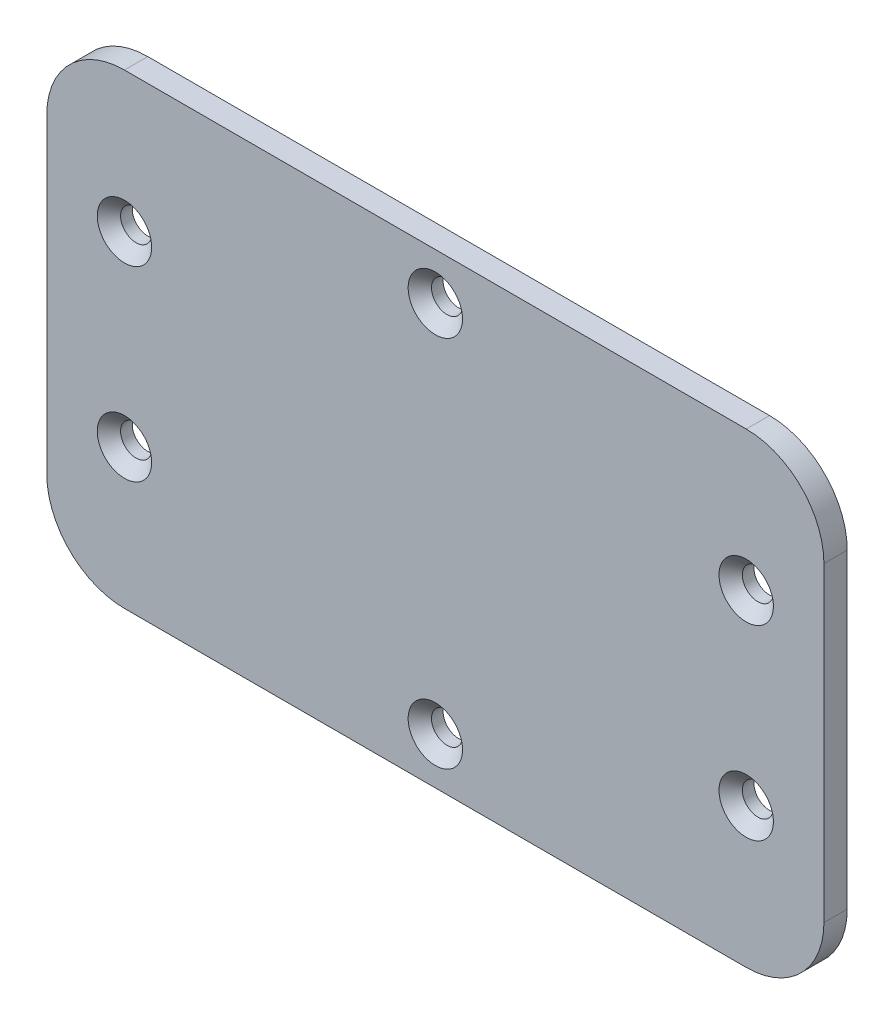
ISO-10303-21;
HEADER;
FILE_DESCRIPTION(('STEP AP214'),'2;1');
FILE_NAME('part.step','',(''),(''),'','','');
FILE_SCHEMA(('AUTOMOTIVE_DESIGN { 1 0 10303 214 1 1 1 1 }'));
ENDSEC;
DATA;
#1=APPLICATION_CONTEXT('core data for automotive mechanical design processes');
#2=APPLICATION_PROTOCOL_DEFINITION('international standard','automotive_design',2000,#1);
#3=PRODUCT_CONTEXT('',#1,'mechanical');
#4=PRODUCT('Part','Part','',(#3));
#5=PRODUCT_RELATED_PRODUCT_CATEGORY('part','',(#4));
#6=PRODUCT_DEFINITION_FORMATION('','',#4);
#7=PRODUCT_DEFINITION_CONTEXT('part definition',#1,'design');
#8=PRODUCT_DEFINITION('design','',#6,#7);
#9=PRODUCT_DEFINITION_SHAPE('','',#8);
#10=(LENGTH_UNIT() NAMED_UNIT(*) SI_UNIT(.MILLI.,.METRE.));
#11=(NAMED_UNIT(*) PLANE_ANGLE_UNIT() SI_UNIT($,.RADIAN.));
#12=(NAMED_UNIT(*) SI_UNIT($,.STERADIAN.) SOLID_ANGLE_UNIT());
#13=UNCERTAINTY_MEASURE_WITH_UNIT(LENGTH_MEASURE(1.E-05),#10,'distance_accuracy_value','');
#14=(GEOMETRIC_REPRESENTATION_CONTEXT(3) GLOBAL_UNCERTAINTY_ASSIGNED_CONTEXT((#13)) GLOBAL_UNIT_ASSIGNED_CONTEXT((#10,
#11,#12)) REPRESENTATION_CONTEXT('',''));
#15=CARTESIAN_POINT('',(0.,0.,0.));
#16=DIRECTION('',(0.,0.,1.));
#17=DIRECTION('',(1.,0.,0.));
#18=AXIS2_PLACEMENT_3D('',#15,#16,#17);
#19=CARTESIAN_POINT('',(-25.,15.,-1.5));
#20=DIRECTION('',(-1.,0.,0.));
#21=DIRECTION('',(0.,0.,1.));
#22=AXIS2_PLACEMENT_3D('',#19,#20,#21);
#23=PLANE('',#22);
#24=DIRECTION('',(0.,-1.,0.));
#25=VECTOR('',#24,1.);
#26=CARTESIAN_POINT('',(-25.,15.,-1.5));
#27=LINE('',#26,#25);
#28=CARTESIAN_POINT('',(-25.,10.,-1.5));
#29=VERTEX_POINT('',#28);
#30=CARTESIAN_POINT('',(-25.,-10.,-1.5));
#31=VERTEX_POINT('',#30);
#32=EDGE_CURVE('E213',#29,#31,#27,.T.);
#33=ORIENTED_EDGE('',*,*,#32,.T.);
#34=DIRECTION('',(0.,0.,1.));
#35=VECTOR('',#34,1.);
#36=CARTESIAN_POINT('',(-25.,-10.,-1.5));
#37=LINE('',#36,#35);
#38=CARTESIAN_POINT('',(-25.,-10.,0.));
#39=VERTEX_POINT('',#38);
#40=EDGE_CURVE('E11',#31,#39,#37,.T.);
#41=ORIENTED_EDGE('',*,*,#40,.T.);
#42=DIRECTION('',(0.,-1.,0.));
#43=VECTOR('',#42,1.);
#44=CARTESIAN_POINT('',(-25.,15.,0.));
#45=LINE('',#44,#43);
#46=CARTESIAN_POINT('',(-25.,10.,0.));
#47=VERTEX_POINT('',#46);
#48=EDGE_CURVE('E212',#47,#39,#45,.T.);
#49=ORIENTED_EDGE('',*,*,#48,.F.);
#50=DIRECTION('',(0.,0.,1.));
#51=VECTOR('',#50,1.);
#52=CARTESIAN_POINT('',(-25.,10.,-1.5));
#53=LINE('',#52,#51);
#54=EDGE_CURVE('E48',#47,#29,#53,.F.);
#55=ORIENTED_EDGE('',*,*,#54,.T.);
#56=EDGE_LOOP('',(#33,#41,#49,#55));
#57=FACE_BOUND('',#56,.T.);
#58=ADVANCED_FACE('F39',(#57),#23,.T.);
#59=CARTESIAN_POINT('',(-25.,15.,-1.5));
#60=DIRECTION('',(0.,1.,0.));
#61=DIRECTION('',(0.,0.,1.));
#62=AXIS2_PLACEMENT_3D('',#59,#60,#61);
#63=PLANE('',#62);
#64=DIRECTION('',(-1.,0.,0.));
#65=VECTOR('',#64,1.);
#66=CARTESIAN_POINT('',(-25.,15.,0.));
#67=LINE('',#66,#65);
#68=CARTESIAN_POINT('',(20.,15.,0.));
#69=VERTEX_POINT('',#68);
#70=CARTESIAN_POINT('',(-20.,15.,0.));
#71=VERTEX_POINT('',#70);
#72=EDGE_CURVE('E127',#69,#71,#67,.T.);
#73=ORIENTED_EDGE('',*,*,#72,.F.);
#74=DIRECTION('',(0.,0.,1.));
#75=VECTOR('',#74,1.);
#76=CARTESIAN_POINT('',(20.,15.,-1.5));
#77=LINE('',#76,#75);
#78=CARTESIAN_POINT('',(20.,15.,-1.5));
#79=VERTEX_POINT('',#78);
#80=EDGE_CURVE('E145',#69,#79,#77,.F.);
#81=ORIENTED_EDGE('',*,*,#80,.T.);
#82=DIRECTION('',(-1.,0.,0.));
#83=VECTOR('',#82,1.);
#84=CARTESIAN_POINT('',(-25.,15.,-1.5));
#85=LINE('',#84,#83);
#86=CARTESIAN_POINT('',(-20.,15.,-1.5));
#87=VERTEX_POINT('',#86);
#88=EDGE_CURVE('E130',#79,#87,#85,.T.);
#89=ORIENTED_EDGE('',*,*,#88,.T.);
#90=DIRECTION('',(0.,0.,1.));
#91=VECTOR('',#90,1.);
#92=CARTESIAN_POINT('',(-20.,15.,-1.5));
#93=LINE('',#92,#91);
#94=EDGE_CURVE('E142',#87,#71,#93,.T.);
#95=ORIENTED_EDGE('',*,*,#94,.T.);
#96=EDGE_LOOP('',(#73,#81,#89,#95));
#97=FACE_BOUND('',#96,.T.);
#98=ADVANCED_FACE('F235',(#97),#63,.T.);
#99=CARTESIAN_POINT('',(25.,15.,-1.5));
#100=DIRECTION('',(1.,0.,0.));
#101=DIRECTION('',(0.,0.,-1.));
#102=AXIS2_PLACEMENT_3D('',#99,#100,#101);
#103=PLANE('',#102);
#104=DIRECTION('',(0.,1.,0.));
#105=VECTOR('',#104,1.);
#106=CARTESIAN_POINT('',(25.,15.,-1.5));
#107=LINE('',#106,#105);
#108=CARTESIAN_POINT('',(25.,-10.,-1.5));
#109=VERTEX_POINT('',#108);
#110=CARTESIAN_POINT('',(25.,10.,-1.5));
#111=VERTEX_POINT('',#110);
#112=EDGE_CURVE('E135',#109,#111,#107,.T.);
#113=ORIENTED_EDGE('',*,*,#112,.T.);
#114=DIRECTION('',(0.,0.,1.));
#115=VECTOR('',#114,1.);
#116=CARTESIAN_POINT('',(25.,10.,-1.5));
#117=LINE('',#116,#115);
#118=CARTESIAN_POINT('',(25.,10.,0.));
#119=VERTEX_POINT('',#118);
#120=EDGE_CURVE('E126',#111,#119,#117,.T.);
#121=ORIENTED_EDGE('',*,*,#120,.T.);
#122=DIRECTION('',(0.,1.,0.));
#123=VECTOR('',#122,1.);
#124=CARTESIAN_POINT('',(25.,15.,0.));
#125=LINE('',#124,#123);
#126=CARTESIAN_POINT('',(25.,-10.,0.));
#127=VERTEX_POINT('',#126);
#128=EDGE_CURVE('E111',#127,#119,#125,.T.);
#129=ORIENTED_EDGE('',*,*,#128,.F.);
#130=DIRECTION('',(0.,0.,1.));
#131=VECTOR('',#130,1.);
#132=CARTESIAN_POINT('',(25.,-10.,-1.5));
#133=LINE('',#132,#131);
#134=EDGE_CURVE('E124',#127,#109,#133,.F.);
#135=ORIENTED_EDGE('',*,*,#134,.T.);
#136=EDGE_LOOP('',(#113,#121,#129,#135));
#137=FACE_BOUND('',#136,.T.);
#138=ADVANCED_FACE('F123',(#137),#103,.T.);
#139=CARTESIAN_POINT('',(-25.,-15.,-1.5));
#140=DIRECTION('',(0.,-1.,0.));
#141=DIRECTION('',(0.,0.,-1.));
#142=AXIS2_PLACEMENT_3D('',#139,#140,#141);
#143=PLANE('',#142);
#144=DIRECTION('',(1.,0.,0.));
#145=VECTOR('',#144,1.);
#146=CARTESIAN_POINT('',(-25.,-15.,-1.5));
#147=LINE('',#146,#145);
#148=CARTESIAN_POINT('',(-20.,-15.,-1.5));
#149=VERTEX_POINT('',#148);
#150=CARTESIAN_POINT('',(20.,-15.,-1.5));
#151=VERTEX_POINT('',#150);
#152=EDGE_CURVE('E216',#149,#151,#147,.T.);
#153=ORIENTED_EDGE('',*,*,#152,.T.);
#154=DIRECTION('',(0.,0.,1.));
#155=VECTOR('',#154,1.);
#156=CARTESIAN_POINT('',(20.,-15.,-1.5));
#157=LINE('',#156,#155);
#158=CARTESIAN_POINT('',(20.,-15.,0.));
#159=VERTEX_POINT('',#158);
#160=EDGE_CURVE('E155',#151,#159,#157,.T.);
#161=ORIENTED_EDGE('',*,*,#160,.T.);
#162=DIRECTION('',(1.,0.,0.));
#163=VECTOR('',#162,1.);
#164=CARTESIAN_POINT('',(-25.,-15.,0.));
#165=LINE('',#164,#163);
#166=CARTESIAN_POINT('',(-20.,-15.,0.));
#167=VERTEX_POINT('',#166);
#168=EDGE_CURVE('E112',#167,#159,#165,.T.);
#169=ORIENTED_EDGE('',*,*,#168,.F.);
#170=DIRECTION('',(0.,0.,1.));
#171=VECTOR('',#170,1.);
#172=CARTESIAN_POINT('',(-20.,-15.,-1.5));
#173=LINE('',#172,#171);
#174=EDGE_CURVE('E63',#167,#149,#173,.F.);
#175=ORIENTED_EDGE('',*,*,#174,.T.);
#176=EDGE_LOOP('',(#153,#161,#169,#175));
#177=FACE_BOUND('',#176,.T.);
#178=ADVANCED_FACE('F257',(#177),#143,.T.);
#179=CARTESIAN_POINT('',(0.,0.,-1.5));
#180=DIRECTION('',(0.,0.,1.));
#181=DIRECTION('',(1.,0.,0.));
#182=AXIS2_PLACEMENT_3D('',#179,#180,#181);
#183=PLANE('',#182);
#184=CARTESIAN_POINT('',(20.,-6.,-1.5));
#185=DIRECTION('',(0.,0.,-1.));
#186=DIRECTION('',(-1.,0.,0.));
#187=AXIS2_PLACEMENT_3D('',#184,#185,#186);
#188=CIRCLE('',#187,1.);
#189=CARTESIAN_POINT('',(19.,-6.,-1.5));
#190=VERTEX_POINT('',#189);
#191=EDGE_CURVE('E186',#190,#190,#188,.T.);
#192=ORIENTED_EDGE('',*,*,#191,.F.);
#193=EDGE_LOOP('',(#192));
#194=FACE_BOUND('',#193,.T.);
#195=CARTESIAN_POINT('',(0.,-12.,-1.5));
#196=DIRECTION('',(0.,0.,-1.));
#197=DIRECTION('',(-1.,0.,0.));
#198=AXIS2_PLACEMENT_3D('',#195,#196,#197);
#199=CIRCLE('',#198,1.);
#200=CARTESIAN_POINT('',(-1.,-12.,-1.5));
#201=VERTEX_POINT('',#200);
#202=EDGE_CURVE('E176',#201,#201,#199,.T.);
#203=ORIENTED_EDGE('',*,*,#202,.F.);
#204=EDGE_LOOP('',(#203));
#205=FACE_BOUND('',#204,.T.);
#206=CARTESIAN_POINT('',(-20.,-5.99999999999999,-1.5));
#207=DIRECTION('',(0.,0.,-1.));
#208=DIRECTION('',(-1.,0.,0.));
#209=AXIS2_PLACEMENT_3D('',#206,#207,#208);
#210=CIRCLE('',#209,1.);
#211=CARTESIAN_POINT('',(-21.,-5.99999999999999,-1.5));
#212=VERTEX_POINT('',#211);
#213=EDGE_CURVE('E173',#212,#212,#210,.T.);
#214=ORIENTED_EDGE('',*,*,#213,.F.);
#215=EDGE_LOOP('',(#214));
#216=FACE_BOUND('',#215,.T.);
#217=CARTESIAN_POINT('',(-20.,6.00000000000001,-1.5));
#218=DIRECTION('',(0.,0.,-1.));
#219=DIRECTION('',(-1.,0.,0.));
#220=AXIS2_PLACEMENT_3D('',#217,#218,#219);
#221=CIRCLE('',#220,1.);
#222=CARTESIAN_POINT('',(-21.,6.00000000000001,-1.5));
#223=VERTEX_POINT('',#222);
#224=EDGE_CURVE('E170',#223,#223,#221,.T.);
#225=ORIENTED_EDGE('',*,*,#224,.F.);
#226=EDGE_LOOP('',(#225));
#227=FACE_BOUND('',#226,.T.);
#228=CARTESIAN_POINT('',(0.,12.,-1.5));
#229=DIRECTION('',(0.,0.,-1.));
#230=DIRECTION('',(-1.,0.,0.));
#231=AXIS2_PLACEMENT_3D('',#228,#229,#230);
#232=CIRCLE('',#231,1.);
#233=CARTESIAN_POINT('',(-1.,12.,-1.5));
#234=VERTEX_POINT('',#233);
#235=EDGE_CURVE('E166',#234,#234,#232,.T.);
#236=ORIENTED_EDGE('',*,*,#235,.F.);
#237=EDGE_LOOP('',(#236));
#238=FACE_BOUND('',#237,.T.);
#239=CARTESIAN_POINT('',(20.,6.,-1.5));
#240=DIRECTION('',(0.,0.,-1.));
#241=DIRECTION('',(-1.,0.,0.));
#242=AXIS2_PLACEMENT_3D('',#239,#240,#241);
#243=CIRCLE('',#242,1.);
#244=CARTESIAN_POINT('',(19.,6.,-1.5));
#245=VERTEX_POINT('',#244);
#246=EDGE_CURVE('E162',#245,#245,#243,.T.);
#247=ORIENTED_EDGE('',*,*,#246,.F.);
#248=EDGE_LOOP('',(#247));
#249=FACE_BOUND('',#248,.T.);
#250=ORIENTED_EDGE('',*,*,#88,.F.);
#251=CARTESIAN_POINT('',(20.,10.,-1.5));
#252=DIRECTION('',(0.,0.,1.));
#253=DIRECTION('',(1.,0.,0.));
#254=AXIS2_PLACEMENT_3D('',#251,#252,#253);
#255=CIRCLE('',#254,5.);
#256=EDGE_CURVE('E152',#79,#111,#255,.F.);
#257=ORIENTED_EDGE('',*,*,#256,.T.);
#258=ORIENTED_EDGE('',*,*,#112,.F.);
#259=CARTESIAN_POINT('',(20.,-10.,-1.5));
#260=DIRECTION('',(0.,0.,1.));
#261=DIRECTION('',(1.,0.,0.));
#262=AXIS2_PLACEMENT_3D('',#259,#260,#261);
#263=CIRCLE('',#262,5.);
#264=EDGE_CURVE('E56',#109,#151,#263,.F.);
#265=ORIENTED_EDGE('',*,*,#264,.T.);
#266=ORIENTED_EDGE('',*,*,#152,.F.);
#267=CARTESIAN_POINT('',(-20.,-10.,-1.5));
#268=DIRECTION('',(0.,0.,1.));
#269=DIRECTION('',(1.,0.,0.));
#270=AXIS2_PLACEMENT_3D('',#267,#268,#269);
#271=CIRCLE('',#270,5.);
#272=EDGE_CURVE('E149',#149,#31,#271,.F.);
#273=ORIENTED_EDGE('',*,*,#272,.T.);
#274=ORIENTED_EDGE('',*,*,#32,.F.);
#275=CARTESIAN_POINT('',(-20.,10.,-1.5));
#276=DIRECTION('',(0.,0.,1.));
#277=DIRECTION('',(1.,0.,0.));
#278=AXIS2_PLACEMENT_3D('',#275,#276,#277);
#279=CIRCLE('',#278,5.);
#280=EDGE_CURVE('E147',#29,#87,#279,.F.);
#281=ORIENTED_EDGE('',*,*,#280,.T.);
#282=EDGE_LOOP('',(#250,#257,#258,#265,#266,#273,#274,#281));
#283=FACE_BOUND('',#282,.T.);
#284=ADVANCED_FACE('F231',(#194,#205,#216,#227,#238,#249,#283),#183,.F.);
#285=CARTESIAN_POINT('',(0.,0.,0.));
#286=DIRECTION('',(0.,0.,1.));
#287=DIRECTION('',(1.,0.,0.));
#288=AXIS2_PLACEMENT_3D('',#285,#286,#287);
#289=PLANE('',#288);
#290=CARTESIAN_POINT('',(20.,6.00000000000001,0.));
#291=DIRECTION('',(0.,0.,1.));
#292=DIRECTION('',(1.,0.,0.));
#293=AXIS2_PLACEMENT_3D('',#290,#291,#292);
#294=CIRCLE('',#293,1.75);
#295=CARTESIAN_POINT('',(21.75,6.00000000000001,0.));
#296=VERTEX_POINT('',#295);
#297=EDGE_CURVE('E161',#296,#296,#294,.T.);
#298=ORIENTED_EDGE('',*,*,#297,.F.);
#299=EDGE_LOOP('',(#298));
#300=FACE_BOUND('',#299,.T.);
#301=CARTESIAN_POINT('',(0.,12.,0.));
#302=DIRECTION('',(0.,0.,1.));
#303=DIRECTION('',(1.,0.,0.));
#304=AXIS2_PLACEMENT_3D('',#301,#302,#303);
#305=CIRCLE('',#304,1.75);
#306=CARTESIAN_POINT('',(1.75,12.,0.));
#307=VERTEX_POINT('',#306);
#308=EDGE_CURVE('E197',#307,#307,#305,.T.);
#309=ORIENTED_EDGE('',*,*,#308,.F.);
#310=EDGE_LOOP('',(#309));
#311=FACE_BOUND('',#310,.T.);
#312=CARTESIAN_POINT('',(-20.,6.00000000000001,0.));
#313=DIRECTION('',(0.,0.,1.));
#314=DIRECTION('',(1.,0.,0.));
#315=AXIS2_PLACEMENT_3D('',#312,#313,#314);
#316=CIRCLE('',#315,1.75);
#317=CARTESIAN_POINT('',(-18.25,6.00000000000001,0.));
#318=VERTEX_POINT('',#317);
#319=EDGE_CURVE('E200',#318,#318,#316,.T.);
#320=ORIENTED_EDGE('',*,*,#319,.F.);
#321=EDGE_LOOP('',(#320));
#322=FACE_BOUND('',#321,.T.);
#323=CARTESIAN_POINT('',(-20.,-5.99999999999999,0.));
#324=DIRECTION('',(0.,0.,1.));
#325=DIRECTION('',(1.,0.,0.));
#326=AXIS2_PLACEMENT_3D('',#323,#324,#325);
#327=CIRCLE('',#326,1.75);
#328=CARTESIAN_POINT('',(-18.25,-5.99999999999999,0.));
#329=VERTEX_POINT('',#328);
#330=EDGE_CURVE('E203',#329,#329,#327,.T.);
#331=ORIENTED_EDGE('',*,*,#330,.F.);
#332=EDGE_LOOP('',(#331));
#333=FACE_BOUND('',#332,.T.);
#334=CARTESIAN_POINT('',(0.,-12.,0.));
#335=DIRECTION('',(0.,0.,1.));
#336=DIRECTION('',(1.,0.,0.));
#337=AXIS2_PLACEMENT_3D('',#334,#335,#336);
#338=CIRCLE('',#337,1.75);
#339=CARTESIAN_POINT('',(1.75,-12.,0.));
#340=VERTEX_POINT('',#339);
#341=EDGE_CURVE('E206',#340,#340,#338,.T.);
#342=ORIENTED_EDGE('',*,*,#341,.F.);
#343=EDGE_LOOP('',(#342));
#344=FACE_BOUND('',#343,.T.);
#345=CARTESIAN_POINT('',(20.,-6.,0.));
#346=DIRECTION('',(0.,0.,1.));
#347=DIRECTION('',(1.,0.,0.));
#348=AXIS2_PLACEMENT_3D('',#345,#346,#347);
#349=CIRCLE('',#348,1.75);
#350=CARTESIAN_POINT('',(21.75,-6.,0.));
#351=VERTEX_POINT('',#350);
#352=EDGE_CURVE('E209',#351,#351,#349,.T.);
#353=ORIENTED_EDGE('',*,*,#352,.F.);
#354=EDGE_LOOP('',(#353));
#355=FACE_BOUND('',#354,.T.);
#356=ORIENTED_EDGE('',*,*,#128,.T.);
#357=CARTESIAN_POINT('',(20.,10.,0.));
#358=DIRECTION('',(0.,0.,1.));
#359=DIRECTION('',(1.,0.,0.));
#360=AXIS2_PLACEMENT_3D('',#357,#358,#359);
#361=CIRCLE('',#360,5.);
#362=EDGE_CURVE('E117',#119,#69,#361,.T.);
#363=ORIENTED_EDGE('',*,*,#362,.T.);
#364=ORIENTED_EDGE('',*,*,#72,.T.);
#365=CARTESIAN_POINT('',(-20.,10.,0.));
#366=DIRECTION('',(0.,0.,1.));
#367=DIRECTION('',(1.,0.,0.));
#368=AXIS2_PLACEMENT_3D('',#365,#366,#367);
#369=CIRCLE('',#368,5.);
#370=EDGE_CURVE('E132',#71,#47,#369,.T.);
#371=ORIENTED_EDGE('',*,*,#370,.T.);
#372=ORIENTED_EDGE('',*,*,#48,.T.);
#373=CARTESIAN_POINT('',(-20.,-10.,0.));
#374=DIRECTION('',(0.,0.,1.));
#375=DIRECTION('',(1.,0.,0.));
#376=AXIS2_PLACEMENT_3D('',#373,#374,#375);
#377=CIRCLE('',#376,5.);
#378=EDGE_CURVE('E118',#39,#167,#377,.T.);
#379=ORIENTED_EDGE('',*,*,#378,.T.);
#380=ORIENTED_EDGE('',*,*,#168,.T.);
#381=CARTESIAN_POINT('',(20.,-10.,0.));
#382=DIRECTION('',(0.,0.,1.));
#383=DIRECTION('',(1.,0.,0.));
#384=AXIS2_PLACEMENT_3D('',#381,#382,#383);
#385=CIRCLE('',#384,5.);
#386=EDGE_CURVE('E108',#159,#127,#385,.T.);
#387=ORIENTED_EDGE('',*,*,#386,.T.);
#388=EDGE_LOOP('',(#356,#363,#364,#371,#372,#379,#380,#387));
#389=FACE_BOUND('',#388,.T.);
#390=ADVANCED_FACE('F110',(#300,#311,#322,#333,#344,#355,#389),#289,.T.);
#391=CARTESIAN_POINT('',(20.,10.,-1.5));
#392=DIRECTION('',(0.,0.,1.));
#393=DIRECTION('',(1.,0.,0.));
#394=AXIS2_PLACEMENT_3D('',#391,#392,#393);
#395=CYLINDRICAL_SURFACE('',#394,5.);
#396=ORIENTED_EDGE('',*,*,#256,.F.);
#397=ORIENTED_EDGE('',*,*,#80,.F.);
#398=ORIENTED_EDGE('',*,*,#362,.F.);
#399=ORIENTED_EDGE('',*,*,#120,.F.);
#400=EDGE_LOOP('',(#396,#397,#398,#399));
#401=FACE_BOUND('',#400,.T.);
#402=ADVANCED_FACE('F238',(#401),#395,.T.);
#403=CARTESIAN_POINT('',(20.,-10.,-1.5));
#404=DIRECTION('',(0.,0.,1.));
#405=DIRECTION('',(1.,0.,0.));
#406=AXIS2_PLACEMENT_3D('',#403,#404,#405);
#407=CYLINDRICAL_SURFACE('',#406,5.);
#408=ORIENTED_EDGE('',*,*,#264,.F.);
#409=ORIENTED_EDGE('',*,*,#134,.F.);
#410=ORIENTED_EDGE('',*,*,#386,.F.);
#411=ORIENTED_EDGE('',*,*,#160,.F.);
#412=EDGE_LOOP('',(#408,#409,#410,#411));
#413=FACE_BOUND('',#412,.T.);
#414=ADVANCED_FACE('F129',(#413),#407,.T.);
#415=CARTESIAN_POINT('',(-20.,-10.,-1.5));
#416=DIRECTION('',(0.,0.,1.));
#417=DIRECTION('',(1.,0.,0.));
#418=AXIS2_PLACEMENT_3D('',#415,#416,#417);
#419=CYLINDRICAL_SURFACE('',#418,5.);
#420=ORIENTED_EDGE('',*,*,#272,.F.);
#421=ORIENTED_EDGE('',*,*,#174,.F.);
#422=ORIENTED_EDGE('',*,*,#378,.F.);
#423=ORIENTED_EDGE('',*,*,#40,.F.);
#424=EDGE_LOOP('',(#420,#421,#422,#423));
#425=FACE_BOUND('',#424,.T.);
#426=ADVANCED_FACE('F245',(#425),#419,.T.);
#427=CARTESIAN_POINT('',(-20.,10.,-1.5));
#428=DIRECTION('',(0.,0.,1.));
#429=DIRECTION('',(1.,0.,0.));
#430=AXIS2_PLACEMENT_3D('',#427,#428,#429);
#431=CYLINDRICAL_SURFACE('',#430,5.);
#432=ORIENTED_EDGE('',*,*,#280,.F.);
#433=ORIENTED_EDGE('',*,*,#54,.F.);
#434=ORIENTED_EDGE('',*,*,#370,.F.);
#435=ORIENTED_EDGE('',*,*,#94,.F.);
#436=EDGE_LOOP('',(#432,#433,#434,#435));
#437=FACE_BOUND('',#436,.T.);
#438=ADVANCED_FACE('F41',(#437),#431,.T.);
#439=CARTESIAN_POINT('',(20.,-6.,0.));
#440=DIRECTION('',(0.,0.,1.));
#441=DIRECTION('',(1.,0.,0.));
#442=AXIS2_PLACEMENT_3D('',#439,#440,#441);
#443=CONICAL_SURFACE('',#442,1.75,0.78539816339745);
#444=CARTESIAN_POINT('',(20.,-6.,-0.749999999999998));
#445=DIRECTION('',(0.,0.,1.));
#446=DIRECTION('',(1.,0.,0.));
#447=AXIS2_PLACEMENT_3D('',#444,#445,#446);
#448=CIRCLE('',#447,1.);
#449=CARTESIAN_POINT('',(21.,-6.,-0.749999999999998));
#450=VERTEX_POINT('',#449);
#451=EDGE_CURVE('E43',#450,#450,#448,.F.);
#452=ORIENTED_EDGE('',*,*,#451,.T.);
#453=EDGE_LOOP('',(#452));
#454=FACE_BOUND('',#453,.T.);
#455=ORIENTED_EDGE('',*,*,#352,.T.);
#456=EDGE_LOOP('',(#455));
#457=FACE_BOUND('',#456,.T.);
#458=ADVANCED_FACE('F265',(#454,#457),#443,.F.);
#459=CARTESIAN_POINT('',(0.,-12.,0.));
#460=DIRECTION('',(0.,0.,1.));
#461=DIRECTION('',(1.,0.,0.));
#462=AXIS2_PLACEMENT_3D('',#459,#460,#461);
#463=CONICAL_SURFACE('',#462,1.75,0.785398163397449);
#464=CARTESIAN_POINT('',(0.,-12.,-0.749999999999998));
#465=DIRECTION('',(0.,0.,1.));
#466=DIRECTION('',(1.,0.,0.));
#467=AXIS2_PLACEMENT_3D('',#464,#465,#466);
#468=CIRCLE('',#467,1.);
#469=CARTESIAN_POINT('',(1.,-12.,-0.749999999999998));
#470=VERTEX_POINT('',#469);
#471=EDGE_CURVE('E174',#470,#470,#468,.F.);
#472=ORIENTED_EDGE('',*,*,#471,.T.);
#473=EDGE_LOOP('',(#472));
#474=FACE_BOUND('',#473,.T.);
#475=ORIENTED_EDGE('',*,*,#341,.T.);
#476=EDGE_LOOP('',(#475));
#477=FACE_BOUND('',#476,.T.);
#478=ADVANCED_FACE('F268',(#474,#477),#463,.F.);
#479=CARTESIAN_POINT('',(-20.,-5.99999999999999,0.));
#480=DIRECTION('',(0.,0.,1.));
#481=DIRECTION('',(1.,0.,0.));
#482=AXIS2_PLACEMENT_3D('',#479,#480,#481);
#483=CONICAL_SURFACE('',#482,1.75,0.78539816339745);
#484=CARTESIAN_POINT('',(-20.,-5.99999999999999,-0.749999999999998));
#485=DIRECTION('',(0.,0.,1.));
#486=DIRECTION('',(1.,0.,0.));
#487=AXIS2_PLACEMENT_3D('',#484,#485,#486);
#488=CIRCLE('',#487,1.);
#489=CARTESIAN_POINT('',(-19.,-5.99999999999999,-0.749999999999998));
#490=VERTEX_POINT('',#489);
#491=EDGE_CURVE('E171',#490,#490,#488,.F.);
#492=ORIENTED_EDGE('',*,*,#491,.T.);
#493=EDGE_LOOP('',(#492));
#494=FACE_BOUND('',#493,.T.);
#495=ORIENTED_EDGE('',*,*,#330,.T.);
#496=EDGE_LOOP('',(#495));
#497=FACE_BOUND('',#496,.T.);
#498=ADVANCED_FACE('F272',(#494,#497),#483,.F.);
#499=CARTESIAN_POINT('',(-20.,6.00000000000001,0.));
#500=DIRECTION('',(0.,0.,1.));
#501=DIRECTION('',(1.,0.,0.));
#502=AXIS2_PLACEMENT_3D('',#499,#500,#501);
#503=CONICAL_SURFACE('',#502,1.75,0.78539816339745);
#504=CARTESIAN_POINT('',(-20.,6.00000000000001,-0.749999999999998));
#505=DIRECTION('',(0.,0.,1.));
#506=DIRECTION('',(1.,0.,0.));
#507=AXIS2_PLACEMENT_3D('',#504,#505,#506);
#508=CIRCLE('',#507,1.);
#509=CARTESIAN_POINT('',(-19.,6.00000000000001,-0.749999999999998));
#510=VERTEX_POINT('',#509);
#511=EDGE_CURVE('E167',#510,#510,#508,.F.);
#512=ORIENTED_EDGE('',*,*,#511,.T.);
#513=EDGE_LOOP('',(#512));
#514=FACE_BOUND('',#513,.T.);
#515=ORIENTED_EDGE('',*,*,#319,.T.);
#516=EDGE_LOOP('',(#515));
#517=FACE_BOUND('',#516,.T.);
#518=ADVANCED_FACE('F275',(#514,#517),#503,.F.);
#519=CARTESIAN_POINT('',(0.,12.,0.));
#520=DIRECTION('',(0.,0.,1.));
#521=DIRECTION('',(1.,0.,0.));
#522=AXIS2_PLACEMENT_3D('',#519,#520,#521);
#523=CONICAL_SURFACE('',#522,1.75,0.785398163397449);
#524=CARTESIAN_POINT('',(0.,12.,-0.749999999999998));
#525=DIRECTION('',(0.,0.,1.));
#526=DIRECTION('',(1.,0.,0.));
#527=AXIS2_PLACEMENT_3D('',#524,#525,#526);
#528=CIRCLE('',#527,1.);
#529=CARTESIAN_POINT('',(1.,12.,-0.749999999999998));
#530=VERTEX_POINT('',#529);
#531=EDGE_CURVE('E163',#530,#530,#528,.F.);
#532=ORIENTED_EDGE('',*,*,#531,.T.);
#533=EDGE_LOOP('',(#532));
#534=FACE_BOUND('',#533,.T.);
#535=ORIENTED_EDGE('',*,*,#308,.T.);
#536=EDGE_LOOP('',(#535));
#537=FACE_BOUND('',#536,.T.);
#538=ADVANCED_FACE('F279',(#534,#537),#523,.F.);
#539=CARTESIAN_POINT('',(20.,6.00000000000001,0.));
#540=DIRECTION('',(0.,0.,1.));
#541=DIRECTION('',(1.,0.,0.));
#542=AXIS2_PLACEMENT_3D('',#539,#540,#541);
#543=CONICAL_SURFACE('',#542,1.75,0.78539816339745);
#544=CARTESIAN_POINT('',(20.,6.00000000000001,-0.749999999999998));
#545=DIRECTION('',(0.,0.,1.));
#546=DIRECTION('',(1.,0.,0.));
#547=AXIS2_PLACEMENT_3D('',#544,#545,#546);
#548=CIRCLE('',#547,1.);
#549=CARTESIAN_POINT('',(21.,6.00000000000001,-0.749999999999998));
#550=VERTEX_POINT('',#549);
#551=EDGE_CURVE('E158',#550,#550,#548,.F.);
#552=ORIENTED_EDGE('',*,*,#551,.T.);
#553=EDGE_LOOP('',(#552));
#554=FACE_BOUND('',#553,.T.);
#555=ORIENTED_EDGE('',*,*,#297,.T.);
#556=EDGE_LOOP('',(#555));
#557=FACE_BOUND('',#556,.T.);
#558=ADVANCED_FACE('F283',(#554,#557),#543,.F.);
#559=CARTESIAN_POINT('',(20.,6.,0.));
#560=DIRECTION('',(0.,0.,-1.));
#561=DIRECTION('',(-1.,0.,0.));
#562=AXIS2_PLACEMENT_3D('',#559,#560,#561);
#563=CYLINDRICAL_SURFACE('',#562,1.);
#564=ORIENTED_EDGE('',*,*,#246,.T.);
#565=EDGE_LOOP('',(#564));
#566=FACE_BOUND('',#565,.T.);
#567=ORIENTED_EDGE('',*,*,#551,.F.);
#568=EDGE_LOOP('',(#567));
#569=FACE_BOUND('',#568,.T.);
#570=ADVANCED_FACE('F287',(#566,#569),#563,.F.);
#571=CARTESIAN_POINT('',(0.,12.,0.));
#572=DIRECTION('',(0.,0.,-1.));
#573=DIRECTION('',(-1.,0.,0.));
#574=AXIS2_PLACEMENT_3D('',#571,#572,#573);
#575=CYLINDRICAL_SURFACE('',#574,1.);
#576=ORIENTED_EDGE('',*,*,#235,.T.);
#577=EDGE_LOOP('',(#576));
#578=FACE_BOUND('',#577,.T.);
#579=ORIENTED_EDGE('',*,*,#531,.F.);
#580=EDGE_LOOP('',(#579));
#581=FACE_BOUND('',#580,.T.);
#582=ADVANCED_FACE('F291',(#578,#581),#575,.F.);
#583=CARTESIAN_POINT('',(-20.,6.00000000000001,0.));
#584=DIRECTION('',(0.,0.,-1.));
#585=DIRECTION('',(-1.,0.,0.));
#586=AXIS2_PLACEMENT_3D('',#583,#584,#585);
#587=CYLINDRICAL_SURFACE('',#586,1.);
#588=ORIENTED_EDGE('',*,*,#224,.T.);
#589=EDGE_LOOP('',(#588));
#590=FACE_BOUND('',#589,.T.);
#591=ORIENTED_EDGE('',*,*,#511,.F.);
#592=EDGE_LOOP('',(#591));
#593=FACE_BOUND('',#592,.T.);
#594=ADVANCED_FACE('F295',(#590,#593),#587,.F.);
#595=CARTESIAN_POINT('',(-20.,-5.99999999999999,0.));
#596=DIRECTION('',(0.,0.,-1.));
#597=DIRECTION('',(-1.,0.,0.));
#598=AXIS2_PLACEMENT_3D('',#595,#596,#597);
#599=CYLINDRICAL_SURFACE('',#598,1.);
#600=ORIENTED_EDGE('',*,*,#213,.T.);
#601=EDGE_LOOP('',(#600));
#602=FACE_BOUND('',#601,.T.);
#603=ORIENTED_EDGE('',*,*,#491,.F.);
#604=EDGE_LOOP('',(#603));
#605=FACE_BOUND('',#604,.T.);
#606=ADVANCED_FACE('F299',(#602,#605),#599,.F.);
#607=CARTESIAN_POINT('',(0.,-12.,0.));
#608=DIRECTION('',(0.,0.,-1.));
#609=DIRECTION('',(-1.,0.,0.));
#610=AXIS2_PLACEMENT_3D('',#607,#608,#609);
#611=CYLINDRICAL_SURFACE('',#610,1.);
#612=ORIENTED_EDGE('',*,*,#202,.T.);
#613=EDGE_LOOP('',(#612));
#614=FACE_BOUND('',#613,.T.);
#615=ORIENTED_EDGE('',*,*,#471,.F.);
#616=EDGE_LOOP('',(#615));
#617=FACE_BOUND('',#616,.T.);
#618=ADVANCED_FACE('F303',(#614,#617),#611,.F.);
#619=CARTESIAN_POINT('',(20.,-6.,0.));
#620=DIRECTION('',(0.,0.,-1.));
#621=DIRECTION('',(-1.,0.,0.));
#622=AXIS2_PLACEMENT_3D('',#619,#620,#621);
#623=CYLINDRICAL_SURFACE('',#622,1.);
#624=ORIENTED_EDGE('',*,*,#191,.T.);
#625=EDGE_LOOP('',(#624));
#626=FACE_BOUND('',#625,.T.);
#627=ORIENTED_EDGE('',*,*,#451,.F.);
#628=EDGE_LOOP('',(#627));
#629=FACE_BOUND('',#628,.T.);
#630=ADVANCED_FACE('F307',(#626,#629),#623,.F.);
#631=CLOSED_SHELL('',(#58,#98,#138,#178,#284,#390,#402,#414,#426,#438,#458,#478,#498,#518,#538,
#558,#570,#582,#594,#606,#618,#630));
#632=MANIFOLD_SOLID_BREP('B2',#631);
#633=ADVANCED_BREP_SHAPE_REPRESENTATION('',(#18,#632),#14);
#634=SHAPE_DEFINITION_REPRESENTATION(#9,#633);
ENDSEC;
END-ISO-10303-21;
